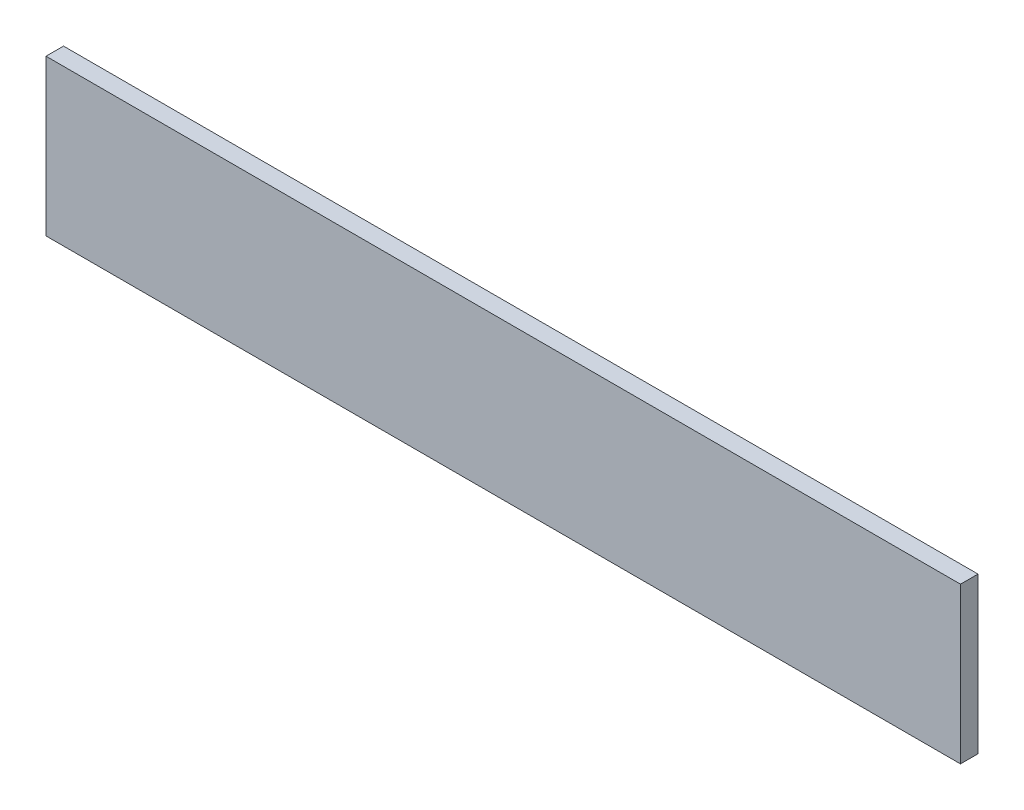
ISO-10303-21;
HEADER;
FILE_DESCRIPTION(('STEP AP214'),'2;1');
FILE_NAME('part.step','',(''),(''),'','','');
FILE_SCHEMA(('AUTOMOTIVE_DESIGN { 1 0 10303 214 1 1 1 1 }'));
ENDSEC;
DATA;
#1=APPLICATION_CONTEXT('core data for automotive mechanical design processes');
#2=APPLICATION_PROTOCOL_DEFINITION('international standard','automotive_design',2000,#1);
#3=PRODUCT_CONTEXT('',#1,'mechanical');
#4=PRODUCT('Part','Part','',(#3));
#5=PRODUCT_RELATED_PRODUCT_CATEGORY('part','',(#4));
#6=PRODUCT_DEFINITION_FORMATION('','',#4);
#7=PRODUCT_DEFINITION_CONTEXT('part definition',#1,'design');
#8=PRODUCT_DEFINITION('design','',#6,#7);
#9=PRODUCT_DEFINITION_SHAPE('','',#8);
#10=(LENGTH_UNIT() NAMED_UNIT(*) SI_UNIT(.MILLI.,.METRE.));
#11=(NAMED_UNIT(*) PLANE_ANGLE_UNIT() SI_UNIT($,.RADIAN.));
#12=(NAMED_UNIT(*) SI_UNIT($,.STERADIAN.) SOLID_ANGLE_UNIT());
#13=UNCERTAINTY_MEASURE_WITH_UNIT(LENGTH_MEASURE(1.E-05),#10,'distance_accuracy_value','');
#14=(GEOMETRIC_REPRESENTATION_CONTEXT(3) GLOBAL_UNCERTAINTY_ASSIGNED_CONTEXT((#13)) GLOBAL_UNIT_ASSIGNED_CONTEXT((#10,
#11,#12)) REPRESENTATION_CONTEXT('',''));
#15=CARTESIAN_POINT('',(0.,0.,0.));
#16=DIRECTION('',(0.,0.,1.));
#17=DIRECTION('',(1.,0.,0.));
#18=AXIS2_PLACEMENT_3D('',#15,#16,#17);
#19=CARTESIAN_POINT('',(0.,0.,-9.));
#20=DIRECTION('',(-1.,0.,0.));
#21=DIRECTION('',(0.,-1.,0.));
#22=AXIS2_PLACEMENT_3D('',#19,#20,#21);
#23=PLANE('',#22);
#24=DIRECTION('',(0.,-1.,0.));
#25=VECTOR('',#24,1.);
#26=CARTESIAN_POINT('',(0.,0.,0.));
#27=LINE('',#26,#25);
#28=CARTESIAN_POINT('',(0.,80.,0.));
#29=VERTEX_POINT('',#28);
#30=CARTESIAN_POINT('',(0.,0.,0.));
#31=VERTEX_POINT('',#30);
#32=EDGE_CURVE('E99',#29,#31,#27,.T.);
#33=ORIENTED_EDGE('',*,*,#32,.F.);
#34=DIRECTION('',(0.,0.,1.));
#35=VECTOR('',#34,1.);
#36=CARTESIAN_POINT('',(0.,80.,-9.));
#37=LINE('',#36,#35);
#38=CARTESIAN_POINT('',(0.,80.,-9.));
#39=VERTEX_POINT('',#38);
#40=EDGE_CURVE('E11',#39,#29,#37,.T.);
#41=ORIENTED_EDGE('',*,*,#40,.F.);
#42=DIRECTION('',(0.,-1.,0.));
#43=VECTOR('',#42,1.);
#44=CARTESIAN_POINT('',(0.,0.,-9.));
#45=LINE('',#44,#43);
#46=CARTESIAN_POINT('',(0.,0.,-9.));
#47=VERTEX_POINT('',#46);
#48=EDGE_CURVE('E93',#39,#47,#45,.T.);
#49=ORIENTED_EDGE('',*,*,#48,.T.);
#50=DIRECTION('',(0.,0.,1.));
#51=VECTOR('',#50,1.);
#52=CARTESIAN_POINT('',(0.,0.,-9.));
#53=LINE('',#52,#51);
#54=EDGE_CURVE('E38',#47,#31,#53,.T.);
#55=ORIENTED_EDGE('',*,*,#54,.T.);
#56=EDGE_LOOP('',(#33,#41,#49,#55));
#57=FACE_BOUND('',#56,.T.);
#58=ADVANCED_FACE('F35',(#57),#23,.T.);
#59=CARTESIAN_POINT('',(0.,80.,-9.));
#60=DIRECTION('',(0.,1.,0.));
#61=DIRECTION('',(0.,0.,1.));
#62=AXIS2_PLACEMENT_3D('',#59,#60,#61);
#63=PLANE('',#62);
#64=DIRECTION('',(-1.,0.,0.));
#65=VECTOR('',#64,1.);
#66=CARTESIAN_POINT('',(0.,80.,0.));
#67=LINE('',#66,#65);
#68=CARTESIAN_POINT('',(470.,80.,0.));
#69=VERTEX_POINT('',#68);
#70=EDGE_CURVE('E95',#69,#29,#67,.T.);
#71=ORIENTED_EDGE('',*,*,#70,.F.);
#72=DIRECTION('',(0.,0.,1.));
#73=VECTOR('',#72,1.);
#74=CARTESIAN_POINT('',(470.,80.,-9.));
#75=LINE('',#74,#73);
#76=CARTESIAN_POINT('',(470.,80.,-9.));
#77=VERTEX_POINT('',#76);
#78=EDGE_CURVE('E44',#77,#69,#75,.T.);
#79=ORIENTED_EDGE('',*,*,#78,.F.);
#80=DIRECTION('',(-1.,0.,0.));
#81=VECTOR('',#80,1.);
#82=CARTESIAN_POINT('',(0.,80.,-9.));
#83=LINE('',#82,#81);
#84=EDGE_CURVE('E90',#77,#39,#83,.T.);
#85=ORIENTED_EDGE('',*,*,#84,.T.);
#86=ORIENTED_EDGE('',*,*,#40,.T.);
#87=EDGE_LOOP('',(#71,#79,#85,#86));
#88=FACE_BOUND('',#87,.T.);
#89=ADVANCED_FACE('F109',(#88),#63,.T.);
#90=CARTESIAN_POINT('',(470.,0.,-9.));
#91=DIRECTION('',(1.,0.,0.));
#92=DIRECTION('',(0.,1.,0.));
#93=AXIS2_PLACEMENT_3D('',#90,#91,#92);
#94=PLANE('',#93);
#95=DIRECTION('',(0.,1.,0.));
#96=VECTOR('',#95,1.);
#97=CARTESIAN_POINT('',(470.,0.,0.));
#98=LINE('',#97,#96);
#99=CARTESIAN_POINT('',(470.,0.,0.));
#100=VERTEX_POINT('',#99);
#101=EDGE_CURVE('E85',#100,#69,#98,.T.);
#102=ORIENTED_EDGE('',*,*,#101,.F.);
#103=DIRECTION('',(0.,0.,1.));
#104=VECTOR('',#103,1.);
#105=CARTESIAN_POINT('',(470.,0.,-9.));
#106=LINE('',#105,#104);
#107=CARTESIAN_POINT('',(470.,0.,-9.));
#108=VERTEX_POINT('',#107);
#109=EDGE_CURVE('E80',#108,#100,#106,.T.);
#110=ORIENTED_EDGE('',*,*,#109,.F.);
#111=DIRECTION('',(0.,1.,0.));
#112=VECTOR('',#111,1.);
#113=CARTESIAN_POINT('',(470.,0.,-9.));
#114=LINE('',#113,#112);
#115=EDGE_CURVE('E83',#108,#77,#114,.T.);
#116=ORIENTED_EDGE('',*,*,#115,.T.);
#117=ORIENTED_EDGE('',*,*,#78,.T.);
#118=EDGE_LOOP('',(#102,#110,#116,#117));
#119=FACE_BOUND('',#118,.T.);
#120=ADVANCED_FACE('F82',(#119),#94,.T.);
#121=CARTESIAN_POINT('',(0.,0.,-9.));
#122=DIRECTION('',(0.,-1.,0.));
#123=DIRECTION('',(0.,0.,-1.));
#124=AXIS2_PLACEMENT_3D('',#121,#122,#123);
#125=PLANE('',#124);
#126=DIRECTION('',(1.,0.,0.));
#127=VECTOR('',#126,1.);
#128=CARTESIAN_POINT('',(0.,0.,0.));
#129=LINE('',#128,#127);
#130=EDGE_CURVE('E102',#31,#100,#129,.T.);
#131=ORIENTED_EDGE('',*,*,#130,.F.);
#132=ORIENTED_EDGE('',*,*,#54,.F.);
#133=DIRECTION('',(1.,0.,0.));
#134=VECTOR('',#133,1.);
#135=CARTESIAN_POINT('',(0.,0.,-9.));
#136=LINE('',#135,#134);
#137=EDGE_CURVE('E89',#47,#108,#136,.T.);
#138=ORIENTED_EDGE('',*,*,#137,.T.);
#139=ORIENTED_EDGE('',*,*,#109,.T.);
#140=EDGE_LOOP('',(#131,#132,#138,#139));
#141=FACE_BOUND('',#140,.T.);
#142=ADVANCED_FACE('F92',(#141),#125,.T.);
#143=CARTESIAN_POINT('',(0.,0.,-9.));
#144=DIRECTION('',(0.,0.,-1.));
#145=DIRECTION('',(-1.,0.,0.));
#146=AXIS2_PLACEMENT_3D('',#143,#144,#145);
#147=PLANE('',#146);
#148=ORIENTED_EDGE('',*,*,#48,.F.);
#149=ORIENTED_EDGE('',*,*,#84,.F.);
#150=ORIENTED_EDGE('',*,*,#115,.F.);
#151=ORIENTED_EDGE('',*,*,#137,.F.);
#152=EDGE_LOOP('',(#148,#149,#150,#151));
#153=FACE_BOUND('',#152,.T.);
#154=ADVANCED_FACE('F88',(#153),#147,.T.);
#155=CARTESIAN_POINT('',(0.,0.,0.));
#156=DIRECTION('',(0.,0.,-1.));
#157=DIRECTION('',(-1.,0.,0.));
#158=AXIS2_PLACEMENT_3D('',#155,#156,#157);
#159=PLANE('',#158);
#160=ORIENTED_EDGE('',*,*,#32,.T.);
#161=ORIENTED_EDGE('',*,*,#130,.T.);
#162=ORIENTED_EDGE('',*,*,#101,.T.);
#163=ORIENTED_EDGE('',*,*,#70,.T.);
#164=EDGE_LOOP('',(#160,#161,#162,#163));
#165=FACE_BOUND('',#164,.T.);
#166=ADVANCED_FACE('F108',(#165),#159,.F.);
#167=CLOSED_SHELL('',(#58,#89,#120,#142,#154,#166));
#168=MANIFOLD_SOLID_BREP('B2',#167);
#169=ADVANCED_BREP_SHAPE_REPRESENTATION('',(#18,#168),#14);
#170=SHAPE_DEFINITION_REPRESENTATION(#9,#169);
ENDSEC;
END-ISO-10303-21;
